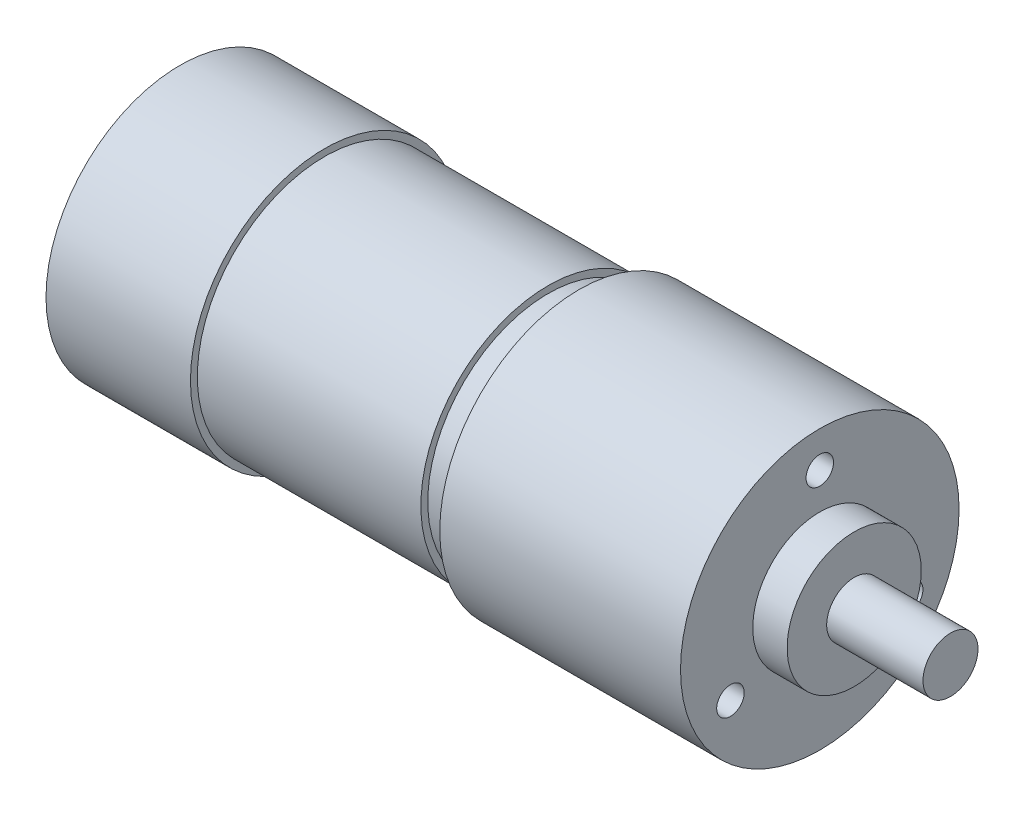
ISO-10303-21;
HEADER;
FILE_DESCRIPTION(('STEP AP214'),'2;1');
FILE_NAME('part.step','',(''),(''),'','','');
FILE_SCHEMA(('AUTOMOTIVE_DESIGN { 1 0 10303 214 1 1 1 1 }'));
ENDSEC;
DATA;
#1=APPLICATION_CONTEXT('core data for automotive mechanical design processes');
#2=APPLICATION_PROTOCOL_DEFINITION('international standard','automotive_design',2000,#1);
#3=PRODUCT_CONTEXT('',#1,'mechanical');
#4=PRODUCT('Part','Part','',(#3));
#5=PRODUCT_RELATED_PRODUCT_CATEGORY('part','',(#4));
#6=PRODUCT_DEFINITION_FORMATION('','',#4);
#7=PRODUCT_DEFINITION_CONTEXT('part definition',#1,'design');
#8=PRODUCT_DEFINITION('design','',#6,#7);
#9=PRODUCT_DEFINITION_SHAPE('','',#8);
#10=(LENGTH_UNIT() NAMED_UNIT(*) SI_UNIT(.MILLI.,.METRE.));
#11=(NAMED_UNIT(*) PLANE_ANGLE_UNIT() SI_UNIT($,.RADIAN.));
#12=(NAMED_UNIT(*) SI_UNIT($,.STERADIAN.) SOLID_ANGLE_UNIT());
#13=UNCERTAINTY_MEASURE_WITH_UNIT(LENGTH_MEASURE(1.E-05),#10,'distance_accuracy_value','');
#14=(GEOMETRIC_REPRESENTATION_CONTEXT(3) GLOBAL_UNCERTAINTY_ASSIGNED_CONTEXT((#13)) GLOBAL_UNIT_ASSIGNED_CONTEXT((#10,
#11,#12)) REPRESENTATION_CONTEXT('',''));
#15=CARTESIAN_POINT('',(0.,0.,0.));
#16=DIRECTION('',(0.,0.,1.));
#17=DIRECTION('',(1.,0.,0.));
#18=AXIS2_PLACEMENT_3D('',#15,#16,#17);
#19=CARTESIAN_POINT('',(0.,0.,0.));
#20=DIRECTION('',(-1.,0.,0.));
#21=DIRECTION('',(0.,0.,1.));
#22=AXIS2_PLACEMENT_3D('',#19,#20,#21);
#23=PLANE('',#22);
#24=CARTESIAN_POINT('',(0.,0.,0.));
#25=DIRECTION('',(1.,0.,0.));
#26=DIRECTION('',(0.,0.,-1.));
#27=AXIS2_PLACEMENT_3D('',#24,#25,#26);
#28=CIRCLE('',#27,19.5);
#29=CARTESIAN_POINT('',(0.,0.,-19.5));
#30=VERTEX_POINT('',#29);
#31=EDGE_CURVE('E10',#30,#30,#28,.T.);
#32=ORIENTED_EDGE('',*,*,#31,.F.);
#33=EDGE_LOOP('',(#32));
#34=FACE_BOUND('',#33,.T.);
#35=ADVANCED_FACE('F34',(#34),#23,.T.);
#36=CARTESIAN_POINT('',(112.,0.,0.));
#37=DIRECTION('',(1.,0.,0.));
#38=DIRECTION('',(0.,0.,-1.));
#39=AXIS2_PLACEMENT_3D('',#36,#37,#38);
#40=CYLINDRICAL_SURFACE('',#39,19.5);
#41=ORIENTED_EDGE('',*,*,#31,.T.);
#42=EDGE_LOOP('',(#41));
#43=FACE_BOUND('',#42,.T.);
#44=CARTESIAN_POINT('',(21.,0.,0.));
#45=DIRECTION('',(1.,0.,0.));
#46=DIRECTION('',(0.,0.,-1.));
#47=AXIS2_PLACEMENT_3D('',#44,#45,#46);
#48=CIRCLE('',#47,19.5);
#49=CARTESIAN_POINT('',(21.,0.,-19.5));
#50=VERTEX_POINT('',#49);
#51=EDGE_CURVE('E40',#50,#50,#48,.T.);
#52=ORIENTED_EDGE('',*,*,#51,.F.);
#53=EDGE_LOOP('',(#52));
#54=FACE_BOUND('',#53,.T.);
#55=ADVANCED_FACE('F147',(#43,#54),#40,.T.);
#56=CARTESIAN_POINT('',(21.,0.,-18.5));
#57=DIRECTION('',(1.,0.,0.));
#58=DIRECTION('',(0.,0.,-1.));
#59=AXIS2_PLACEMENT_3D('',#56,#57,#58);
#60=PLANE('',#59);
#61=ORIENTED_EDGE('',*,*,#51,.T.);
#62=EDGE_LOOP('',(#61));
#63=FACE_BOUND('',#62,.T.);
#64=CARTESIAN_POINT('',(21.,0.,0.));
#65=DIRECTION('',(1.,0.,0.));
#66=DIRECTION('',(0.,0.,-1.));
#67=AXIS2_PLACEMENT_3D('',#64,#65,#66);
#68=CIRCLE('',#67,18.5);
#69=CARTESIAN_POINT('',(21.,0.,-18.5));
#70=VERTEX_POINT('',#69);
#71=EDGE_CURVE('E44',#70,#70,#68,.T.);
#72=ORIENTED_EDGE('',*,*,#71,.F.);
#73=EDGE_LOOP('',(#72));
#74=FACE_BOUND('',#73,.T.);
#75=ADVANCED_FACE('F152',(#63,#74),#60,.T.);
#76=CARTESIAN_POINT('',(112.,0.,0.));
#77=DIRECTION('',(1.,0.,0.));
#78=DIRECTION('',(0.,0.,-1.));
#79=AXIS2_PLACEMENT_3D('',#76,#77,#78);
#80=CYLINDRICAL_SURFACE('',#79,18.5);
#81=ORIENTED_EDGE('',*,*,#71,.T.);
#82=EDGE_LOOP('',(#81));
#83=FACE_BOUND('',#82,.T.);
#84=CARTESIAN_POINT('',(53.5,0.,0.));
#85=DIRECTION('',(1.,0.,0.));
#86=DIRECTION('',(0.,0.,-1.));
#87=AXIS2_PLACEMENT_3D('',#84,#85,#86);
#88=CIRCLE('',#87,18.5);
#89=CARTESIAN_POINT('',(53.5,0.,-18.5));
#90=VERTEX_POINT('',#89);
#91=EDGE_CURVE('E48',#90,#90,#88,.T.);
#92=ORIENTED_EDGE('',*,*,#91,.F.);
#93=EDGE_LOOP('',(#92));
#94=FACE_BOUND('',#93,.T.);
#95=ADVANCED_FACE('F156',(#83,#94),#80,.T.);
#96=CARTESIAN_POINT('',(53.5,0.,-18.5));
#97=DIRECTION('',(1.,0.,0.));
#98=DIRECTION('',(0.,0.,-1.));
#99=AXIS2_PLACEMENT_3D('',#96,#97,#98);
#100=PLANE('',#99);
#101=ORIENTED_EDGE('',*,*,#91,.T.);
#102=EDGE_LOOP('',(#101));
#103=FACE_BOUND('',#102,.T.);
#104=CARTESIAN_POINT('',(53.5,0.,0.));
#105=DIRECTION('',(1.,0.,0.));
#106=DIRECTION('',(0.,0.,-1.));
#107=AXIS2_PLACEMENT_3D('',#104,#105,#106);
#108=CIRCLE('',#107,17.5);
#109=CARTESIAN_POINT('',(53.5,0.,-17.5));
#110=VERTEX_POINT('',#109);
#111=EDGE_CURVE('E53',#110,#110,#108,.T.);
#112=ORIENTED_EDGE('',*,*,#111,.F.);
#113=EDGE_LOOP('',(#112));
#114=FACE_BOUND('',#113,.T.);
#115=ADVANCED_FACE('F162',(#103,#114),#100,.T.);
#116=CARTESIAN_POINT('',(112.,0.,0.));
#117=DIRECTION('',(1.,0.,0.));
#118=DIRECTION('',(0.,0.,-1.));
#119=AXIS2_PLACEMENT_3D('',#116,#117,#118);
#120=CYLINDRICAL_SURFACE('',#119,17.5);
#121=ORIENTED_EDGE('',*,*,#111,.T.);
#122=EDGE_LOOP('',(#121));
#123=FACE_BOUND('',#122,.T.);
#124=CARTESIAN_POINT('',(58.,0.,0.));
#125=DIRECTION('',(1.,0.,0.));
#126=DIRECTION('',(0.,0.,-1.));
#127=AXIS2_PLACEMENT_3D('',#124,#125,#126);
#128=CIRCLE('',#127,17.5);
#129=CARTESIAN_POINT('',(58.,0.,-17.5));
#130=VERTEX_POINT('',#129);
#131=EDGE_CURVE('E56',#130,#130,#128,.T.);
#132=ORIENTED_EDGE('',*,*,#131,.F.);
#133=EDGE_LOOP('',(#132));
#134=FACE_BOUND('',#133,.T.);
#135=ADVANCED_FACE('F166',(#123,#134),#120,.T.);
#136=CARTESIAN_POINT('',(58.,0.,-17.5));
#137=DIRECTION('',(-1.,0.,0.));
#138=DIRECTION('',(0.,0.,1.));
#139=AXIS2_PLACEMENT_3D('',#136,#137,#138);
#140=PLANE('',#139);
#141=ORIENTED_EDGE('',*,*,#131,.T.);
#142=EDGE_LOOP('',(#141));
#143=FACE_BOUND('',#142,.T.);
#144=CARTESIAN_POINT('',(58.,0.,0.));
#145=DIRECTION('',(1.,0.,0.));
#146=DIRECTION('',(0.,0.,-1.));
#147=AXIS2_PLACEMENT_3D('',#144,#145,#146);
#148=CIRCLE('',#147,20.25);
#149=CARTESIAN_POINT('',(58.,0.,-20.25));
#150=VERTEX_POINT('',#149);
#151=EDGE_CURVE('E59',#150,#150,#148,.T.);
#152=ORIENTED_EDGE('',*,*,#151,.F.);
#153=EDGE_LOOP('',(#152));
#154=FACE_BOUND('',#153,.T.);
#155=ADVANCED_FACE('F170',(#143,#154),#140,.T.);
#156=CARTESIAN_POINT('',(112.,0.,0.));
#157=DIRECTION('',(1.,0.,0.));
#158=DIRECTION('',(0.,0.,-1.));
#159=AXIS2_PLACEMENT_3D('',#156,#157,#158);
#160=CYLINDRICAL_SURFACE('',#159,20.25);
#161=ORIENTED_EDGE('',*,*,#151,.T.);
#162=EDGE_LOOP('',(#161));
#163=FACE_BOUND('',#162,.T.);
#164=CARTESIAN_POINT('',(93.,0.,0.));
#165=DIRECTION('',(1.,0.,0.));
#166=DIRECTION('',(0.,0.,-1.));
#167=AXIS2_PLACEMENT_3D('',#164,#165,#166);
#168=CIRCLE('',#167,20.25);
#169=CARTESIAN_POINT('',(93.,0.,-20.25));
#170=VERTEX_POINT('',#169);
#171=EDGE_CURVE('E62',#170,#170,#168,.T.);
#172=ORIENTED_EDGE('',*,*,#171,.F.);
#173=EDGE_LOOP('',(#172));
#174=FACE_BOUND('',#173,.T.);
#175=ADVANCED_FACE('F109',(#163,#174),#160,.T.);
#176=CARTESIAN_POINT('',(93.,0.,-20.25));
#177=DIRECTION('',(1.,0.,0.));
#178=DIRECTION('',(0.,0.,-1.));
#179=AXIS2_PLACEMENT_3D('',#176,#177,#178);
#180=PLANE('',#179);
#181=CARTESIAN_POINT('',(93.,-7.49999999999988,12.9903810567666));
#182=DIRECTION('',(1.,0.,0.));
#183=DIRECTION('',(0.,0.,-1.));
#184=AXIS2_PLACEMENT_3D('',#181,#182,#183);
#185=CIRCLE('',#184,2.);
#186=CARTESIAN_POINT('',(93.,-7.49999999999988,10.9903810567666));
#187=VERTEX_POINT('',#186);
#188=EDGE_CURVE('E90',#187,#187,#185,.T.);
#189=ORIENTED_EDGE('',*,*,#188,.F.);
#190=EDGE_LOOP('',(#189));
#191=FACE_BOUND('',#190,.T.);
#192=CARTESIAN_POINT('',(93.,-7.50000000000006,-12.9903810567665));
#193=DIRECTION('',(1.,0.,0.));
#194=DIRECTION('',(0.,0.,-1.));
#195=AXIS2_PLACEMENT_3D('',#192,#193,#194);
#196=CIRCLE('',#195,2.);
#197=CARTESIAN_POINT('',(93.,-7.50000000000006,-14.9903810567665));
#198=VERTEX_POINT('',#197);
#199=EDGE_CURVE('E84',#198,#198,#196,.T.);
#200=ORIENTED_EDGE('',*,*,#199,.F.);
#201=EDGE_LOOP('',(#200));
#202=FACE_BOUND('',#201,.T.);
#203=CARTESIAN_POINT('',(93.,15.,0.));
#204=DIRECTION('',(1.,0.,0.));
#205=DIRECTION('',(0.,0.,-1.));
#206=AXIS2_PLACEMENT_3D('',#203,#204,#205);
#207=CIRCLE('',#206,2.);
#208=CARTESIAN_POINT('',(93.,15.,-2.));
#209=VERTEX_POINT('',#208);
#210=EDGE_CURVE('E78',#209,#209,#207,.T.);
#211=ORIENTED_EDGE('',*,*,#210,.F.);
#212=EDGE_LOOP('',(#211));
#213=FACE_BOUND('',#212,.T.);
#214=ORIENTED_EDGE('',*,*,#171,.T.);
#215=EDGE_LOOP('',(#214));
#216=FACE_BOUND('',#215,.T.);
#217=CARTESIAN_POINT('',(93.,0.,0.));
#218=DIRECTION('',(1.,0.,0.));
#219=DIRECTION('',(0.,0.,-1.));
#220=AXIS2_PLACEMENT_3D('',#217,#218,#219);
#221=CIRCLE('',#220,9.75);
#222=CARTESIAN_POINT('',(93.,0.,-9.75));
#223=VERTEX_POINT('',#222);
#224=EDGE_CURVE('E65',#223,#223,#221,.T.);
#225=ORIENTED_EDGE('',*,*,#224,.F.);
#226=EDGE_LOOP('',(#225));
#227=FACE_BOUND('',#226,.T.);
#228=ADVANCED_FACE('F105',(#191,#202,#213,#216,#227),#180,.T.);
#229=CARTESIAN_POINT('',(112.,0.,0.));
#230=DIRECTION('',(1.,0.,0.));
#231=DIRECTION('',(0.,0.,-1.));
#232=AXIS2_PLACEMENT_3D('',#229,#230,#231);
#233=CYLINDRICAL_SURFACE('',#232,9.75);
#234=ORIENTED_EDGE('',*,*,#224,.T.);
#235=EDGE_LOOP('',(#234));
#236=FACE_BOUND('',#235,.T.);
#237=CARTESIAN_POINT('',(98.,0.,0.));
#238=DIRECTION('',(1.,0.,0.));
#239=DIRECTION('',(0.,0.,-1.));
#240=AXIS2_PLACEMENT_3D('',#237,#238,#239);
#241=CIRCLE('',#240,9.75);
#242=CARTESIAN_POINT('',(98.,0.,-9.75));
#243=VERTEX_POINT('',#242);
#244=EDGE_CURVE('E68',#243,#243,#241,.T.);
#245=ORIENTED_EDGE('',*,*,#244,.F.);
#246=EDGE_LOOP('',(#245));
#247=FACE_BOUND('',#246,.T.);
#248=ADVANCED_FACE('F108',(#236,#247),#233,.T.);
#249=CARTESIAN_POINT('',(98.,0.,-9.75));
#250=DIRECTION('',(1.,0.,0.));
#251=DIRECTION('',(0.,0.,-1.));
#252=AXIS2_PLACEMENT_3D('',#249,#250,#251);
#253=PLANE('',#252);
#254=ORIENTED_EDGE('',*,*,#244,.T.);
#255=EDGE_LOOP('',(#254));
#256=FACE_BOUND('',#255,.T.);
#257=CARTESIAN_POINT('',(98.,0.,0.));
#258=DIRECTION('',(1.,0.,0.));
#259=DIRECTION('',(0.,0.,-1.));
#260=AXIS2_PLACEMENT_3D('',#257,#258,#259);
#261=CIRCLE('',#260,4.);
#262=CARTESIAN_POINT('',(98.,0.,-4.));
#263=VERTEX_POINT('',#262);
#264=EDGE_CURVE('E71',#263,#263,#261,.T.);
#265=ORIENTED_EDGE('',*,*,#264,.F.);
#266=EDGE_LOOP('',(#265));
#267=FACE_BOUND('',#266,.T.);
#268=ADVANCED_FACE('F121',(#256,#267),#253,.T.);
#269=CARTESIAN_POINT('',(112.,0.,0.));
#270=DIRECTION('',(1.,0.,0.));
#271=DIRECTION('',(0.,0.,-1.));
#272=AXIS2_PLACEMENT_3D('',#269,#270,#271);
#273=CYLINDRICAL_SURFACE('',#272,4.);
#274=ORIENTED_EDGE('',*,*,#264,.T.);
#275=EDGE_LOOP('',(#274));
#276=FACE_BOUND('',#275,.T.);
#277=CARTESIAN_POINT('',(112.,0.,0.));
#278=DIRECTION('',(1.,0.,0.));
#279=DIRECTION('',(0.,0.,-1.));
#280=AXIS2_PLACEMENT_3D('',#277,#278,#279);
#281=CIRCLE('',#280,4.);
#282=CARTESIAN_POINT('',(112.,0.,-4.));
#283=VERTEX_POINT('',#282);
#284=EDGE_CURVE('E74',#283,#283,#281,.T.);
#285=ORIENTED_EDGE('',*,*,#284,.F.);
#286=EDGE_LOOP('',(#285));
#287=FACE_BOUND('',#286,.T.);
#288=ADVANCED_FACE('F127',(#276,#287),#273,.T.);
#289=CARTESIAN_POINT('',(112.,0.,-4.));
#290=DIRECTION('',(1.,0.,0.));
#291=DIRECTION('',(0.,0.,-1.));
#292=AXIS2_PLACEMENT_3D('',#289,#290,#291);
#293=PLANE('',#292);
#294=ORIENTED_EDGE('',*,*,#284,.T.);
#295=EDGE_LOOP('',(#294));
#296=FACE_BOUND('',#295,.T.);
#297=ADVANCED_FACE('F133',(#296),#293,.T.);
#298=CARTESIAN_POINT('',(85.,15.,0.));
#299=DIRECTION('',(1.,0.,0.));
#300=DIRECTION('',(0.,0.,-1.));
#301=AXIS2_PLACEMENT_3D('',#298,#299,#300);
#302=CYLINDRICAL_SURFACE('',#301,2.);
#303=CARTESIAN_POINT('',(85.,15.,0.));
#304=DIRECTION('',(1.,0.,0.));
#305=DIRECTION('',(0.,0.,-1.));
#306=AXIS2_PLACEMENT_3D('',#303,#304,#305);
#307=CIRCLE('',#306,2.);
#308=CARTESIAN_POINT('',(85.,15.,-2.));
#309=VERTEX_POINT('',#308);
#310=EDGE_CURVE('E77',#309,#309,#307,.T.);
#311=ORIENTED_EDGE('',*,*,#310,.F.);
#312=EDGE_LOOP('',(#311));
#313=FACE_BOUND('',#312,.T.);
#314=ORIENTED_EDGE('',*,*,#210,.T.);
#315=EDGE_LOOP('',(#314));
#316=FACE_BOUND('',#315,.T.);
#317=ADVANCED_FACE('F138',(#313,#316),#302,.F.);
#318=CARTESIAN_POINT('',(85.,15.,0.));
#319=DIRECTION('',(1.,0.,0.));
#320=DIRECTION('',(0.,0.,-1.));
#321=AXIS2_PLACEMENT_3D('',#318,#319,#320);
#322=PLANE('',#321);
#323=ORIENTED_EDGE('',*,*,#310,.T.);
#324=EDGE_LOOP('',(#323));
#325=FACE_BOUND('',#324,.T.);
#326=ADVANCED_FACE('F143',(#325),#322,.T.);
#327=CARTESIAN_POINT('',(85.,-7.50000000000006,-12.9903810567665));
#328=DIRECTION('',(1.,0.,0.));
#329=DIRECTION('',(0.,0.,-1.));
#330=AXIS2_PLACEMENT_3D('',#327,#328,#329);
#331=CYLINDRICAL_SURFACE('',#330,2.);
#332=CARTESIAN_POINT('',(85.,-7.50000000000006,-12.9903810567665));
#333=DIRECTION('',(1.,0.,0.));
#334=DIRECTION('',(0.,0.,-1.));
#335=AXIS2_PLACEMENT_3D('',#332,#333,#334);
#336=CIRCLE('',#335,2.);
#337=CARTESIAN_POINT('',(85.,-7.50000000000006,-14.9903810567665));
#338=VERTEX_POINT('',#337);
#339=EDGE_CURVE('E81',#338,#338,#336,.T.);
#340=ORIENTED_EDGE('',*,*,#339,.F.);
#341=EDGE_LOOP('',(#340));
#342=FACE_BOUND('',#341,.T.);
#343=ORIENTED_EDGE('',*,*,#199,.T.);
#344=EDGE_LOOP('',(#343));
#345=FACE_BOUND('',#344,.T.);
#346=ADVANCED_FACE('F219',(#342,#345),#331,.F.);
#347=CARTESIAN_POINT('',(85.,-7.50000000000006,-12.9903810567665));
#348=DIRECTION('',(1.,0.,0.));
#349=DIRECTION('',(0.,0.,-1.));
#350=AXIS2_PLACEMENT_3D('',#347,#348,#349);
#351=PLANE('',#350);
#352=ORIENTED_EDGE('',*,*,#339,.T.);
#353=EDGE_LOOP('',(#352));
#354=FACE_BOUND('',#353,.T.);
#355=ADVANCED_FACE('F101',(#354),#351,.T.);
#356=CARTESIAN_POINT('',(85.,-7.49999999999988,12.9903810567666));
#357=DIRECTION('',(1.,0.,0.));
#358=DIRECTION('',(0.,0.,-1.));
#359=AXIS2_PLACEMENT_3D('',#356,#357,#358);
#360=CYLINDRICAL_SURFACE('',#359,2.);
#361=CARTESIAN_POINT('',(85.,-7.49999999999988,12.9903810567666));
#362=DIRECTION('',(1.,0.,0.));
#363=DIRECTION('',(0.,0.,-1.));
#364=AXIS2_PLACEMENT_3D('',#361,#362,#363);
#365=CIRCLE('',#364,2.);
#366=CARTESIAN_POINT('',(85.,-7.49999999999988,10.9903810567666));
#367=VERTEX_POINT('',#366);
#368=EDGE_CURVE('E87',#367,#367,#365,.T.);
#369=ORIENTED_EDGE('',*,*,#368,.F.);
#370=EDGE_LOOP('',(#369));
#371=FACE_BOUND('',#370,.T.);
#372=ORIENTED_EDGE('',*,*,#188,.T.);
#373=EDGE_LOOP('',(#372));
#374=FACE_BOUND('',#373,.T.);
#375=ADVANCED_FACE('F98',(#371,#374),#360,.F.);
#376=CARTESIAN_POINT('',(85.,-7.49999999999988,12.9903810567666));
#377=DIRECTION('',(1.,0.,0.));
#378=DIRECTION('',(0.,0.,-1.));
#379=AXIS2_PLACEMENT_3D('',#376,#377,#378);
#380=PLANE('',#379);
#381=ORIENTED_EDGE('',*,*,#368,.T.);
#382=EDGE_LOOP('',(#381));
#383=FACE_BOUND('',#382,.T.);
#384=ADVANCED_FACE('F96',(#383),#380,.T.);
#385=CLOSED_SHELL('',(#35,#55,#75,#95,#115,#135,#155,#175,#228,#248,#268,#288,#297,#317,#326,
#346,#355,#375,#384));
#386=MANIFOLD_SOLID_BREP('B2',#385);
#387=ADVANCED_BREP_SHAPE_REPRESENTATION('',(#18,#386),#14);
#388=SHAPE_DEFINITION_REPRESENTATION(#9,#387);
ENDSEC;
END-ISO-10303-21;
